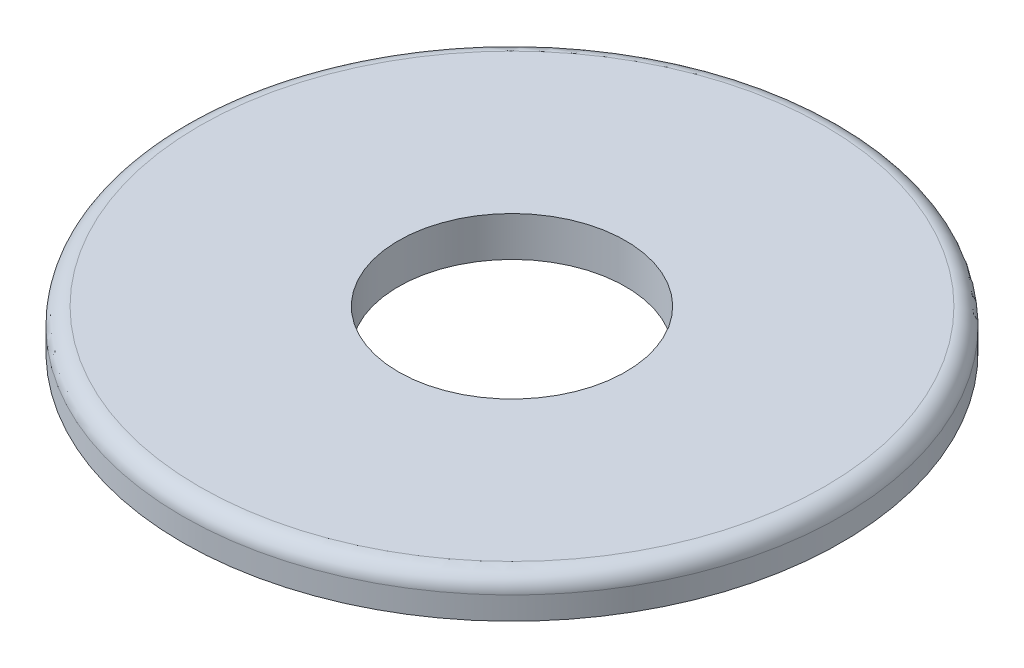
ISO-10303-21;
HEADER;
FILE_DESCRIPTION(('STEP AP214'),'2;1');
FILE_NAME('part.step','',(''),(''),'','','');
FILE_SCHEMA(('AUTOMOTIVE_DESIGN { 1 0 10303 214 1 1 1 1 }'));
ENDSEC;
DATA;
#1=APPLICATION_CONTEXT('core data for automotive mechanical design processes');
#2=APPLICATION_PROTOCOL_DEFINITION('international standard','automotive_design',2000,#1);
#3=PRODUCT_CONTEXT('',#1,'mechanical');
#4=PRODUCT('Part','Part','',(#3));
#5=PRODUCT_RELATED_PRODUCT_CATEGORY('part','',(#4));
#6=PRODUCT_DEFINITION_FORMATION('','',#4);
#7=PRODUCT_DEFINITION_CONTEXT('part definition',#1,'design');
#8=PRODUCT_DEFINITION('design','',#6,#7);
#9=PRODUCT_DEFINITION_SHAPE('','',#8);
#10=(LENGTH_UNIT() NAMED_UNIT(*) SI_UNIT(.MILLI.,.METRE.));
#11=(NAMED_UNIT(*) PLANE_ANGLE_UNIT() SI_UNIT($,.RADIAN.));
#12=(NAMED_UNIT(*) SI_UNIT($,.STERADIAN.) SOLID_ANGLE_UNIT());
#13=UNCERTAINTY_MEASURE_WITH_UNIT(LENGTH_MEASURE(1.E-05),#10,'distance_accuracy_value','');
#14=(GEOMETRIC_REPRESENTATION_CONTEXT(3) GLOBAL_UNCERTAINTY_ASSIGNED_CONTEXT((#13)) GLOBAL_UNIT_ASSIGNED_CONTEXT((#10,
#11,#12)) REPRESENTATION_CONTEXT('',''));
#15=CARTESIAN_POINT('',(0.,0.,0.));
#16=DIRECTION('',(0.,0.,1.));
#17=DIRECTION('',(1.,0.,0.));
#18=AXIS2_PLACEMENT_3D('',#15,#16,#17);
#19=CARTESIAN_POINT('',(0.,22.225,0.));
#20=DIRECTION('',(0.,1.,0.));
#21=DIRECTION('',(0.,0.,1.));
#22=AXIS2_PLACEMENT_3D('',#19,#20,#21);
#23=PLANE('',#22);
#24=CARTESIAN_POINT('',(0.,22.225,0.));
#25=DIRECTION('',(0.,1.,0.));
#26=DIRECTION('',(0.,0.,1.));
#27=AXIS2_PLACEMENT_3D('',#24,#25,#26);
#28=CIRCLE('',#27,174.625);
#29=CARTESIAN_POINT('',(0.,22.225,174.625));
#30=VERTEX_POINT('',#29);
#31=EDGE_CURVE('E44',#30,#30,#28,.T.);
#32=ORIENTED_EDGE('',*,*,#31,.T.);
#33=EDGE_LOOP('',(#32));
#34=FACE_BOUND('',#33,.T.);
#35=CARTESIAN_POINT('',(0.,22.225,0.));
#36=DIRECTION('',(0.,1.,0.));
#37=DIRECTION('',(0.,0.,1.));
#38=AXIS2_PLACEMENT_3D('',#35,#36,#37);
#39=CIRCLE('',#38,63.5);
#40=CARTESIAN_POINT('',(0.,22.225,63.5));
#41=VERTEX_POINT('',#40);
#42=EDGE_CURVE('E54',#41,#41,#39,.T.);
#43=ORIENTED_EDGE('',*,*,#42,.F.);
#44=EDGE_LOOP('',(#43));
#45=FACE_BOUND('',#44,.T.);
#46=ADVANCED_FACE('F36',(#34,#45),#23,.T.);
#47=CARTESIAN_POINT('',(0.,0.,0.));
#48=DIRECTION('',(0.,1.,0.));
#49=DIRECTION('',(0.,0.,1.));
#50=AXIS2_PLACEMENT_3D('',#47,#48,#49);
#51=PLANE('',#50);
#52=CARTESIAN_POINT('',(0.,0.,0.));
#53=DIRECTION('',(0.,1.,0.));
#54=DIRECTION('',(0.,0.,1.));
#55=AXIS2_PLACEMENT_3D('',#52,#53,#54);
#56=CIRCLE('',#55,184.15);
#57=CARTESIAN_POINT('',(0.,0.,184.15));
#58=VERTEX_POINT('',#57);
#59=EDGE_CURVE('E50',#58,#58,#56,.T.);
#60=ORIENTED_EDGE('',*,*,#59,.F.);
#61=EDGE_LOOP('',(#60));
#62=FACE_BOUND('',#61,.T.);
#63=CARTESIAN_POINT('',(0.,0.,0.));
#64=DIRECTION('',(0.,1.,0.));
#65=DIRECTION('',(0.,0.,1.));
#66=AXIS2_PLACEMENT_3D('',#63,#64,#65);
#67=CIRCLE('',#66,63.5);
#68=CARTESIAN_POINT('',(0.,0.,63.5));
#69=VERTEX_POINT('',#68);
#70=EDGE_CURVE('E57',#69,#69,#67,.T.);
#71=ORIENTED_EDGE('',*,*,#70,.T.);
#72=EDGE_LOOP('',(#71));
#73=FACE_BOUND('',#72,.T.);
#74=ADVANCED_FACE('F69',(#62,#73),#51,.F.);
#75=CARTESIAN_POINT('',(0.,22.225,0.));
#76=DIRECTION('',(0.,-1.,0.));
#77=DIRECTION('',(0.,0.,-1.));
#78=AXIS2_PLACEMENT_3D('',#75,#76,#77);
#79=CYLINDRICAL_SURFACE('',#78,184.15);
#80=CARTESIAN_POINT('',(0.,12.7,0.));
#81=DIRECTION('',(0.,1.,0.));
#82=DIRECTION('',(0.,0.,1.));
#83=AXIS2_PLACEMENT_3D('',#80,#81,#82);
#84=CIRCLE('',#83,184.15);
#85=CARTESIAN_POINT('',(0.,12.7,184.15));
#86=VERTEX_POINT('',#85);
#87=EDGE_CURVE('E10',#86,#86,#84,.F.);
#88=ORIENTED_EDGE('',*,*,#87,.T.);
#89=EDGE_LOOP('',(#88));
#90=FACE_BOUND('',#89,.T.);
#91=ORIENTED_EDGE('',*,*,#59,.T.);
#92=EDGE_LOOP('',(#91));
#93=FACE_BOUND('',#92,.T.);
#94=ADVANCED_FACE('F73',(#90,#93),#79,.T.);
#95=CARTESIAN_POINT('',(0.,22.225,0.));
#96=DIRECTION('',(0.,-1.,0.));
#97=DIRECTION('',(0.,0.,-1.));
#98=AXIS2_PLACEMENT_3D('',#95,#96,#97);
#99=CYLINDRICAL_SURFACE('',#98,63.5);
#100=ORIENTED_EDGE('',*,*,#42,.T.);
#101=EDGE_LOOP('',(#100));
#102=FACE_BOUND('',#101,.T.);
#103=ORIENTED_EDGE('',*,*,#70,.F.);
#104=EDGE_LOOP('',(#103));
#105=FACE_BOUND('',#104,.T.);
#106=ADVANCED_FACE('F65',(#102,#105),#99,.F.);
#107=CARTESIAN_POINT('',(0.,12.7,0.));
#108=DIRECTION('',(0.,1.,0.));
#109=DIRECTION('',(0.,0.,1.));
#110=AXIS2_PLACEMENT_3D('',#107,#108,#109);
#111=TOROIDAL_SURFACE('',#110,174.625,9.525);
#112=ORIENTED_EDGE('',*,*,#87,.F.);
#113=EDGE_LOOP('',(#112));
#114=FACE_BOUND('',#113,.T.);
#115=ORIENTED_EDGE('',*,*,#31,.F.);
#116=EDGE_LOOP('',(#115));
#117=FACE_BOUND('',#116,.T.);
#118=ADVANCED_FACE('F38',(#114,#117),#111,.T.);
#119=CLOSED_SHELL('',(#46,#74,#94,#106,#118));
#120=MANIFOLD_SOLID_BREP('B2',#119);
#121=ADVANCED_BREP_SHAPE_REPRESENTATION('',(#18,#120),#14);
#122=SHAPE_DEFINITION_REPRESENTATION(#9,#121);
ENDSEC;
END-ISO-10303-21;
